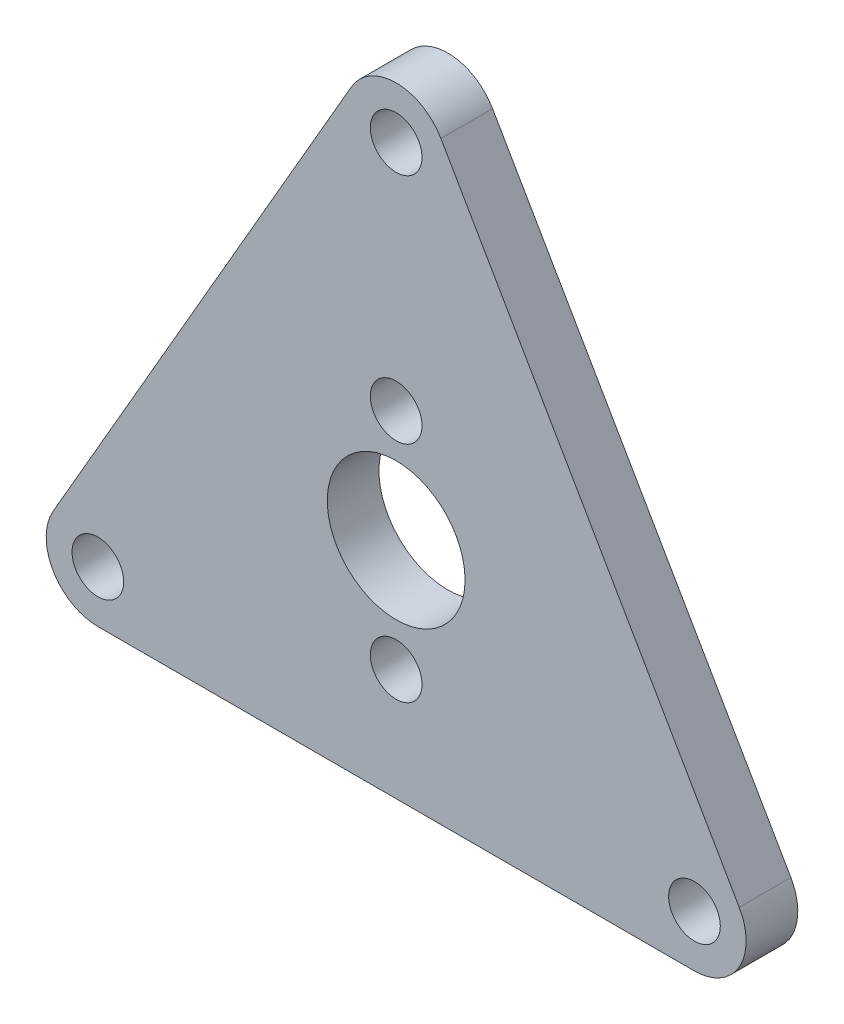
ISO-10303-21;
HEADER;
FILE_DESCRIPTION(('STEP AP214'),'2;1');
FILE_NAME('part.step','',(''),(''),'','','');
FILE_SCHEMA(('AUTOMOTIVE_DESIGN { 1 0 10303 214 1 1 1 1 }'));
ENDSEC;
DATA;
#1=APPLICATION_CONTEXT('core data for automotive mechanical design processes');
#2=APPLICATION_PROTOCOL_DEFINITION('international standard','automotive_design',2000,#1);
#3=PRODUCT_CONTEXT('',#1,'mechanical');
#4=PRODUCT('Part','Part','',(#3));
#5=PRODUCT_RELATED_PRODUCT_CATEGORY('part','',(#4));
#6=PRODUCT_DEFINITION_FORMATION('','',#4);
#7=PRODUCT_DEFINITION_CONTEXT('part definition',#1,'design');
#8=PRODUCT_DEFINITION('design','',#6,#7);
#9=PRODUCT_DEFINITION_SHAPE('','',#8);
#10=(LENGTH_UNIT() NAMED_UNIT(*) SI_UNIT(.MILLI.,.METRE.));
#11=(NAMED_UNIT(*) PLANE_ANGLE_UNIT() SI_UNIT($,.RADIAN.));
#12=(NAMED_UNIT(*) SI_UNIT($,.STERADIAN.) SOLID_ANGLE_UNIT());
#13=UNCERTAINTY_MEASURE_WITH_UNIT(LENGTH_MEASURE(1.E-05),#10,'distance_accuracy_value','');
#14=(GEOMETRIC_REPRESENTATION_CONTEXT(3) GLOBAL_UNCERTAINTY_ASSIGNED_CONTEXT((#13)) GLOBAL_UNIT_ASSIGNED_CONTEXT((#10,
#11,#12)) REPRESENTATION_CONTEXT('',''));
#15=CARTESIAN_POINT('',(0.,0.,0.));
#16=DIRECTION('',(0.,0.,1.));
#17=DIRECTION('',(1.,0.,0.));
#18=AXIS2_PLACEMENT_3D('',#15,#16,#17);
#19=CARTESIAN_POINT('',(-17.3205080756888,-9.99999999999999,3.));
#20=DIRECTION('',(0.,0.,1.));
#21=DIRECTION('',(1.,0.,0.));
#22=AXIS2_PLACEMENT_3D('',#19,#20,#21);
#23=PLANE('',#22);
#24=CARTESIAN_POINT('',(0.,6.5,3.));
#25=DIRECTION('',(0.,0.,1.));
#26=DIRECTION('',(1.,0.,0.));
#27=AXIS2_PLACEMENT_3D('',#24,#25,#26);
#28=CIRCLE('',#27,1.5);
#29=CARTESIAN_POINT('',(1.5,6.5,3.));
#30=VERTEX_POINT('',#29);
#31=EDGE_CURVE('E198',#30,#30,#28,.T.);
#32=ORIENTED_EDGE('',*,*,#31,.F.);
#33=EDGE_LOOP('',(#32));
#34=FACE_BOUND('',#33,.T.);
#35=CARTESIAN_POINT('',(17.3205080756888,-10.,3.));
#36=DIRECTION('',(0.,0.,1.));
#37=DIRECTION('',(1.,0.,0.));
#38=AXIS2_PLACEMENT_3D('',#35,#36,#37);
#39=CIRCLE('',#38,1.5);
#40=CARTESIAN_POINT('',(18.8205080756888,-10.,3.));
#41=VERTEX_POINT('',#40);
#42=EDGE_CURVE('E210',#41,#41,#39,.T.);
#43=ORIENTED_EDGE('',*,*,#42,.F.);
#44=EDGE_LOOP('',(#43));
#45=FACE_BOUND('',#44,.T.);
#46=CARTESIAN_POINT('',(-17.3205080756888,-10.,3.));
#47=DIRECTION('',(0.,0.,1.));
#48=DIRECTION('',(1.,0.,0.));
#49=AXIS2_PLACEMENT_3D('',#46,#47,#48);
#50=CIRCLE('',#49,1.5);
#51=CARTESIAN_POINT('',(-15.8205080756888,-10.,3.));
#52=VERTEX_POINT('',#51);
#53=EDGE_CURVE('E123',#52,#52,#50,.T.);
#54=ORIENTED_EDGE('',*,*,#53,.F.);
#55=EDGE_LOOP('',(#54));
#56=FACE_BOUND('',#55,.T.);
#57=CARTESIAN_POINT('',(-17.3205080756888,-9.99999999999999,3.));
#58=DIRECTION('',(0.,0.,1.));
#59=DIRECTION('',(1.,0.,0.));
#60=AXIS2_PLACEMENT_3D('',#57,#58,#59);
#61=CIRCLE('',#60,3.);
#62=CARTESIAN_POINT('',(-19.9185842870421,-8.49999999999999,3.));
#63=VERTEX_POINT('',#62);
#64=CARTESIAN_POINT('',(-17.3205080756888,-13.,3.));
#65=VERTEX_POINT('',#64);
#66=EDGE_CURVE('E130',#63,#65,#61,.T.);
#67=ORIENTED_EDGE('',*,*,#66,.T.);
#68=DIRECTION('',(1.,0.,0.));
#69=VECTOR('',#68,1.);
#70=CARTESIAN_POINT('',(-17.3205080756888,-13.,3.));
#71=LINE('',#70,#69);
#72=CARTESIAN_POINT('',(17.3205080756888,-13.,3.));
#73=VERTEX_POINT('',#72);
#74=EDGE_CURVE('E88',#65,#73,#71,.T.);
#75=ORIENTED_EDGE('',*,*,#74,.T.);
#76=CARTESIAN_POINT('',(17.3205080756888,-9.99999999999999,3.));
#77=DIRECTION('',(0.,0.,1.));
#78=DIRECTION('',(1.,0.,0.));
#79=AXIS2_PLACEMENT_3D('',#76,#77,#78);
#80=CIRCLE('',#79,3.);
#81=CARTESIAN_POINT('',(19.9185842870421,-8.49999999999999,3.));
#82=VERTEX_POINT('',#81);
#83=EDGE_CURVE('E101',#73,#82,#80,.T.);
#84=ORIENTED_EDGE('',*,*,#83,.T.);
#85=DIRECTION('',(-0.5,0.866025403784439,0.));
#86=VECTOR('',#85,1.);
#87=CARTESIAN_POINT('',(19.9185842870421,-8.49999999999999,3.));
#88=LINE('',#87,#86);
#89=CARTESIAN_POINT('',(2.59807621135331,21.5,3.));
#90=VERTEX_POINT('',#89);
#91=EDGE_CURVE('E95',#82,#90,#88,.T.);
#92=ORIENTED_EDGE('',*,*,#91,.T.);
#93=CARTESIAN_POINT('',(0.,20.,3.));
#94=DIRECTION('',(0.,0.,1.));
#95=DIRECTION('',(-1.,0.,0.));
#96=AXIS2_PLACEMENT_3D('',#93,#94,#95);
#97=CIRCLE('',#96,3.);
#98=CARTESIAN_POINT('',(-2.59807621135331,21.5,3.));
#99=VERTEX_POINT('',#98);
#100=EDGE_CURVE('E99',#90,#99,#97,.T.);
#101=ORIENTED_EDGE('',*,*,#100,.T.);
#102=DIRECTION('',(-0.5,-0.866025403784439,0.));
#103=VECTOR('',#102,1.);
#104=CARTESIAN_POINT('',(-2.59807621135331,21.5,3.));
#105=LINE('',#104,#103);
#106=EDGE_CURVE('E51',#99,#63,#105,.T.);
#107=ORIENTED_EDGE('',*,*,#106,.T.);
#108=EDGE_LOOP('',(#67,#75,#84,#92,#101,#107));
#109=FACE_BOUND('',#108,.T.);
#110=CARTESIAN_POINT('',(0.,20.,3.));
#111=DIRECTION('',(0.,0.,1.));
#112=DIRECTION('',(1.,0.,0.));
#113=AXIS2_PLACEMENT_3D('',#110,#111,#112);
#114=CIRCLE('',#113,1.5);
#115=CARTESIAN_POINT('',(1.5,20.,3.));
#116=VERTEX_POINT('',#115);
#117=EDGE_CURVE('E216',#116,#116,#114,.T.);
#118=ORIENTED_EDGE('',*,*,#117,.F.);
#119=EDGE_LOOP('',(#118));
#120=FACE_BOUND('',#119,.T.);
#121=CARTESIAN_POINT('',(0.,0.,3.));
#122=DIRECTION('',(0.,0.,1.));
#123=DIRECTION('',(1.,0.,0.));
#124=AXIS2_PLACEMENT_3D('',#121,#122,#123);
#125=CIRCLE('',#124,4.);
#126=CARTESIAN_POINT('',(4.,0.,3.));
#127=VERTEX_POINT('',#126);
#128=EDGE_CURVE('E204',#127,#127,#125,.T.);
#129=ORIENTED_EDGE('',*,*,#128,.F.);
#130=EDGE_LOOP('',(#129));
#131=FACE_BOUND('',#130,.T.);
#132=CARTESIAN_POINT('',(0.,-6.5,3.));
#133=DIRECTION('',(0.,0.,1.));
#134=DIRECTION('',(1.,0.,0.));
#135=AXIS2_PLACEMENT_3D('',#132,#133,#134);
#136=CIRCLE('',#135,1.5);
#137=CARTESIAN_POINT('',(1.5,-6.5,3.));
#138=VERTEX_POINT('',#137);
#139=EDGE_CURVE('E189',#138,#138,#136,.T.);
#140=ORIENTED_EDGE('',*,*,#139,.F.);
#141=EDGE_LOOP('',(#140));
#142=FACE_BOUND('',#141,.T.);
#143=ADVANCED_FACE('F34',(#34,#45,#56,#109,#120,#131,#142),#23,.T.);
#144=CARTESIAN_POINT('',(-17.3205080756888,-9.99999999999999,0.));
#145=DIRECTION('',(0.,0.,1.));
#146=DIRECTION('',(1.,0.,0.));
#147=AXIS2_PLACEMENT_3D('',#144,#145,#146);
#148=PLANE('',#147);
#149=CARTESIAN_POINT('',(-17.3205080756888,-9.99999999999999,0.));
#150=DIRECTION('',(0.,0.,1.));
#151=DIRECTION('',(1.,0.,0.));
#152=AXIS2_PLACEMENT_3D('',#149,#150,#151);
#153=CIRCLE('',#152,3.);
#154=CARTESIAN_POINT('',(-19.9185842870421,-8.49999999999999,0.));
#155=VERTEX_POINT('',#154);
#156=CARTESIAN_POINT('',(-17.3205080756888,-13.,0.));
#157=VERTEX_POINT('',#156);
#158=EDGE_CURVE('E119',#155,#157,#153,.T.);
#159=ORIENTED_EDGE('',*,*,#158,.F.);
#160=DIRECTION('',(-0.5,-0.866025403784439,0.));
#161=VECTOR('',#160,1.);
#162=CARTESIAN_POINT('',(-2.59807621135331,21.5,0.));
#163=LINE('',#162,#161);
#164=CARTESIAN_POINT('',(-2.59807621135331,21.5,0.));
#165=VERTEX_POINT('',#164);
#166=EDGE_CURVE('E80',#165,#155,#163,.T.);
#167=ORIENTED_EDGE('',*,*,#166,.F.);
#168=CARTESIAN_POINT('',(0.,20.,0.));
#169=DIRECTION('',(0.,0.,1.));
#170=DIRECTION('',(-1.,0.,0.));
#171=AXIS2_PLACEMENT_3D('',#168,#169,#170);
#172=CIRCLE('',#171,3.);
#173=CARTESIAN_POINT('',(2.59807621135331,21.5,0.));
#174=VERTEX_POINT('',#173);
#175=EDGE_CURVE('E74',#174,#165,#172,.T.);
#176=ORIENTED_EDGE('',*,*,#175,.F.);
#177=DIRECTION('',(-0.5,0.866025403784439,0.));
#178=VECTOR('',#177,1.);
#179=CARTESIAN_POINT('',(19.9185842870421,-8.49999999999999,0.));
#180=LINE('',#179,#178);
#181=CARTESIAN_POINT('',(19.9185842870421,-8.49999999999999,0.));
#182=VERTEX_POINT('',#181);
#183=EDGE_CURVE('E109',#182,#174,#180,.T.);
#184=ORIENTED_EDGE('',*,*,#183,.F.);
#185=CARTESIAN_POINT('',(17.3205080756888,-9.99999999999999,0.));
#186=DIRECTION('',(0.,0.,1.));
#187=DIRECTION('',(1.,0.,0.));
#188=AXIS2_PLACEMENT_3D('',#185,#186,#187);
#189=CIRCLE('',#188,3.);
#190=CARTESIAN_POINT('',(17.3205080756888,-13.,0.));
#191=VERTEX_POINT('',#190);
#192=EDGE_CURVE('E125',#191,#182,#189,.T.);
#193=ORIENTED_EDGE('',*,*,#192,.F.);
#194=DIRECTION('',(1.,0.,0.));
#195=VECTOR('',#194,1.);
#196=CARTESIAN_POINT('',(-17.3205080756888,-13.,0.));
#197=LINE('',#196,#195);
#198=EDGE_CURVE('E122',#157,#191,#197,.T.);
#199=ORIENTED_EDGE('',*,*,#198,.F.);
#200=EDGE_LOOP('',(#159,#167,#176,#184,#193,#199));
#201=FACE_BOUND('',#200,.T.);
#202=CARTESIAN_POINT('',(-17.3205080756888,-10.,0.));
#203=DIRECTION('',(0.,0.,1.));
#204=DIRECTION('',(1.,0.,0.));
#205=AXIS2_PLACEMENT_3D('',#202,#203,#204);
#206=CIRCLE('',#205,1.5);
#207=CARTESIAN_POINT('',(-15.8205080756888,-10.,0.));
#208=VERTEX_POINT('',#207);
#209=EDGE_CURVE('E219',#208,#208,#206,.T.);
#210=ORIENTED_EDGE('',*,*,#209,.T.);
#211=EDGE_LOOP('',(#210));
#212=FACE_BOUND('',#211,.T.);
#213=CARTESIAN_POINT('',(0.,20.,0.));
#214=DIRECTION('',(0.,0.,1.));
#215=DIRECTION('',(1.,0.,0.));
#216=AXIS2_PLACEMENT_3D('',#213,#214,#215);
#217=CIRCLE('',#216,1.5);
#218=CARTESIAN_POINT('',(1.5,20.,0.));
#219=VERTEX_POINT('',#218);
#220=EDGE_CURVE('E213',#219,#219,#217,.T.);
#221=ORIENTED_EDGE('',*,*,#220,.T.);
#222=EDGE_LOOP('',(#221));
#223=FACE_BOUND('',#222,.T.);
#224=CARTESIAN_POINT('',(17.3205080756888,-10.,0.));
#225=DIRECTION('',(0.,0.,1.));
#226=DIRECTION('',(1.,0.,0.));
#227=AXIS2_PLACEMENT_3D('',#224,#225,#226);
#228=CIRCLE('',#227,1.5);
#229=CARTESIAN_POINT('',(18.8205080756888,-10.,0.));
#230=VERTEX_POINT('',#229);
#231=EDGE_CURVE('E207',#230,#230,#228,.T.);
#232=ORIENTED_EDGE('',*,*,#231,.T.);
#233=EDGE_LOOP('',(#232));
#234=FACE_BOUND('',#233,.T.);
#235=CARTESIAN_POINT('',(0.,0.,0.));
#236=DIRECTION('',(0.,0.,1.));
#237=DIRECTION('',(1.,0.,0.));
#238=AXIS2_PLACEMENT_3D('',#235,#236,#237);
#239=CIRCLE('',#238,4.);
#240=CARTESIAN_POINT('',(4.,0.,0.));
#241=VERTEX_POINT('',#240);
#242=EDGE_CURVE('E201',#241,#241,#239,.T.);
#243=ORIENTED_EDGE('',*,*,#242,.T.);
#244=EDGE_LOOP('',(#243));
#245=FACE_BOUND('',#244,.T.);
#246=CARTESIAN_POINT('',(0.,6.5,0.));
#247=DIRECTION('',(0.,0.,1.));
#248=DIRECTION('',(1.,0.,0.));
#249=AXIS2_PLACEMENT_3D('',#246,#247,#248);
#250=CIRCLE('',#249,1.5);
#251=CARTESIAN_POINT('',(1.5,6.5,0.));
#252=VERTEX_POINT('',#251);
#253=EDGE_CURVE('E195',#252,#252,#250,.T.);
#254=ORIENTED_EDGE('',*,*,#253,.T.);
#255=EDGE_LOOP('',(#254));
#256=FACE_BOUND('',#255,.T.);
#257=CARTESIAN_POINT('',(0.,-6.5,0.));
#258=DIRECTION('',(0.,0.,1.));
#259=DIRECTION('',(1.,0.,0.));
#260=AXIS2_PLACEMENT_3D('',#257,#258,#259);
#261=CIRCLE('',#260,1.5);
#262=CARTESIAN_POINT('',(1.5,-6.5,0.));
#263=VERTEX_POINT('',#262);
#264=EDGE_CURVE('E192',#263,#263,#261,.T.);
#265=ORIENTED_EDGE('',*,*,#264,.T.);
#266=EDGE_LOOP('',(#265));
#267=FACE_BOUND('',#266,.T.);
#268=ADVANCED_FACE('F139',(#201,#212,#223,#234,#245,#256,#267),#148,.F.);
#269=CARTESIAN_POINT('',(-17.3205080756888,-9.99999999999999,3.));
#270=DIRECTION('',(0.,0.,-1.));
#271=DIRECTION('',(-1.,0.,0.));
#272=AXIS2_PLACEMENT_3D('',#269,#270,#271);
#273=CYLINDRICAL_SURFACE('',#272,3.);
#274=ORIENTED_EDGE('',*,*,#158,.T.);
#275=DIRECTION('',(0.,0.,-1.));
#276=VECTOR('',#275,1.);
#277=CARTESIAN_POINT('',(-17.3205080756888,-13.,3.));
#278=LINE('',#277,#276);
#279=EDGE_CURVE('E11',#65,#157,#278,.T.);
#280=ORIENTED_EDGE('',*,*,#279,.F.);
#281=ORIENTED_EDGE('',*,*,#66,.F.);
#282=DIRECTION('',(0.,0.,-1.));
#283=VECTOR('',#282,1.);
#284=CARTESIAN_POINT('',(-19.9185842870421,-8.49999999999999,3.));
#285=LINE('',#284,#283);
#286=EDGE_CURVE('E115',#63,#155,#285,.T.);
#287=ORIENTED_EDGE('',*,*,#286,.T.);
#288=EDGE_LOOP('',(#274,#280,#281,#287));
#289=FACE_BOUND('',#288,.T.);
#290=ADVANCED_FACE('F36',(#289),#273,.T.);
#291=CARTESIAN_POINT('',(-17.3205080756888,-13.,3.));
#292=DIRECTION('',(0.,1.,0.));
#293=DIRECTION('',(0.,0.,1.));
#294=AXIS2_PLACEMENT_3D('',#291,#292,#293);
#295=PLANE('',#294);
#296=ORIENTED_EDGE('',*,*,#198,.T.);
#297=DIRECTION('',(0.,0.,-1.));
#298=VECTOR('',#297,1.);
#299=CARTESIAN_POINT('',(17.3205080756888,-13.,3.));
#300=LINE('',#299,#298);
#301=EDGE_CURVE('E43',#73,#191,#300,.T.);
#302=ORIENTED_EDGE('',*,*,#301,.F.);
#303=ORIENTED_EDGE('',*,*,#74,.F.);
#304=ORIENTED_EDGE('',*,*,#279,.T.);
#305=EDGE_LOOP('',(#296,#302,#303,#304));
#306=FACE_BOUND('',#305,.T.);
#307=ADVANCED_FACE('F295',(#306),#295,.F.);
#308=CARTESIAN_POINT('',(17.3205080756888,-9.99999999999999,3.));
#309=DIRECTION('',(0.,0.,-1.));
#310=DIRECTION('',(-1.,0.,0.));
#311=AXIS2_PLACEMENT_3D('',#308,#309,#310);
#312=CYLINDRICAL_SURFACE('',#311,3.);
#313=ORIENTED_EDGE('',*,*,#192,.T.);
#314=DIRECTION('',(0.,0.,-1.));
#315=VECTOR('',#314,1.);
#316=CARTESIAN_POINT('',(19.9185842870421,-8.49999999999999,3.));
#317=LINE('',#316,#315);
#318=EDGE_CURVE('E110',#82,#182,#317,.T.);
#319=ORIENTED_EDGE('',*,*,#318,.F.);
#320=ORIENTED_EDGE('',*,*,#83,.F.);
#321=ORIENTED_EDGE('',*,*,#301,.T.);
#322=EDGE_LOOP('',(#313,#319,#320,#321));
#323=FACE_BOUND('',#322,.T.);
#324=ADVANCED_FACE('F136',(#323),#312,.T.);
#325=CARTESIAN_POINT('',(19.9185842870421,-8.49999999999999,3.));
#326=DIRECTION('',(-0.866025403784439,-0.5,0.));
#327=DIRECTION('',(0.5,-0.866025403784439,0.));
#328=AXIS2_PLACEMENT_3D('',#325,#326,#327);
#329=PLANE('',#328);
#330=ORIENTED_EDGE('',*,*,#183,.T.);
#331=DIRECTION('',(0.,0.,-1.));
#332=VECTOR('',#331,1.);
#333=CARTESIAN_POINT('',(2.59807621135331,21.5,3.));
#334=LINE('',#333,#332);
#335=EDGE_CURVE('E106',#90,#174,#334,.T.);
#336=ORIENTED_EDGE('',*,*,#335,.F.);
#337=ORIENTED_EDGE('',*,*,#91,.F.);
#338=ORIENTED_EDGE('',*,*,#318,.T.);
#339=EDGE_LOOP('',(#330,#336,#337,#338));
#340=FACE_BOUND('',#339,.T.);
#341=ADVANCED_FACE('F107',(#340),#329,.F.);
#342=CARTESIAN_POINT('',(0.,20.,3.));
#343=DIRECTION('',(0.,0.,-1.));
#344=DIRECTION('',(-1.,0.,0.));
#345=AXIS2_PLACEMENT_3D('',#342,#343,#344);
#346=CYLINDRICAL_SURFACE('',#345,3.);
#347=ORIENTED_EDGE('',*,*,#175,.T.);
#348=DIRECTION('',(0.,0.,-1.));
#349=VECTOR('',#348,1.);
#350=CARTESIAN_POINT('',(-2.59807621135331,21.5,3.));
#351=LINE('',#350,#349);
#352=EDGE_CURVE('E111',#99,#165,#351,.T.);
#353=ORIENTED_EDGE('',*,*,#352,.F.);
#354=ORIENTED_EDGE('',*,*,#100,.F.);
#355=ORIENTED_EDGE('',*,*,#335,.T.);
#356=EDGE_LOOP('',(#347,#353,#354,#355));
#357=FACE_BOUND('',#356,.T.);
#358=ADVANCED_FACE('F113',(#357),#346,.T.);
#359=CARTESIAN_POINT('',(-2.59807621135331,21.5,3.));
#360=DIRECTION('',(0.866025403784438,-0.5,0.));
#361=DIRECTION('',(0.5,0.866025403784439,0.));
#362=AXIS2_PLACEMENT_3D('',#359,#360,#361);
#363=PLANE('',#362);
#364=ORIENTED_EDGE('',*,*,#166,.T.);
#365=ORIENTED_EDGE('',*,*,#286,.F.);
#366=ORIENTED_EDGE('',*,*,#106,.F.);
#367=ORIENTED_EDGE('',*,*,#352,.T.);
#368=EDGE_LOOP('',(#364,#365,#366,#367));
#369=FACE_BOUND('',#368,.T.);
#370=ADVANCED_FACE('F144',(#369),#363,.F.);
#371=CARTESIAN_POINT('',(-17.3205080756888,-10.,3.));
#372=DIRECTION('',(0.,0.,-1.));
#373=DIRECTION('',(-1.,0.,0.));
#374=AXIS2_PLACEMENT_3D('',#371,#372,#373);
#375=CYLINDRICAL_SURFACE('',#374,1.5);
#376=ORIENTED_EDGE('',*,*,#53,.T.);
#377=EDGE_LOOP('',(#376));
#378=FACE_BOUND('',#377,.T.);
#379=ORIENTED_EDGE('',*,*,#209,.F.);
#380=EDGE_LOOP('',(#379));
#381=FACE_BOUND('',#380,.T.);
#382=ADVANCED_FACE('F146',(#378,#381),#375,.F.);
#383=CARTESIAN_POINT('',(0.,20.,3.));
#384=DIRECTION('',(0.,0.,-1.));
#385=DIRECTION('',(-1.,0.,0.));
#386=AXIS2_PLACEMENT_3D('',#383,#384,#385);
#387=CYLINDRICAL_SURFACE('',#386,1.5);
#388=ORIENTED_EDGE('',*,*,#117,.T.);
#389=EDGE_LOOP('',(#388));
#390=FACE_BOUND('',#389,.T.);
#391=ORIENTED_EDGE('',*,*,#220,.F.);
#392=EDGE_LOOP('',(#391));
#393=FACE_BOUND('',#392,.T.);
#394=ADVANCED_FACE('F152',(#390,#393),#387,.F.);
#395=CARTESIAN_POINT('',(17.3205080756888,-10.,3.));
#396=DIRECTION('',(0.,0.,-1.));
#397=DIRECTION('',(-1.,0.,0.));
#398=AXIS2_PLACEMENT_3D('',#395,#396,#397);
#399=CYLINDRICAL_SURFACE('',#398,1.5);
#400=ORIENTED_EDGE('',*,*,#42,.T.);
#401=EDGE_LOOP('',(#400));
#402=FACE_BOUND('',#401,.T.);
#403=ORIENTED_EDGE('',*,*,#231,.F.);
#404=EDGE_LOOP('',(#403));
#405=FACE_BOUND('',#404,.T.);
#406=ADVANCED_FACE('F168',(#402,#405),#399,.F.);
#407=CARTESIAN_POINT('',(0.,0.,3.));
#408=DIRECTION('',(0.,0.,-1.));
#409=DIRECTION('',(-1.,0.,0.));
#410=AXIS2_PLACEMENT_3D('',#407,#408,#409);
#411=CYLINDRICAL_SURFACE('',#410,4.);
#412=ORIENTED_EDGE('',*,*,#128,.T.);
#413=EDGE_LOOP('',(#412));
#414=FACE_BOUND('',#413,.T.);
#415=ORIENTED_EDGE('',*,*,#242,.F.);
#416=EDGE_LOOP('',(#415));
#417=FACE_BOUND('',#416,.T.);
#418=ADVANCED_FACE('F172',(#414,#417),#411,.F.);
#419=CARTESIAN_POINT('',(0.,6.5,3.));
#420=DIRECTION('',(0.,0.,-1.));
#421=DIRECTION('',(-1.,0.,0.));
#422=AXIS2_PLACEMENT_3D('',#419,#420,#421);
#423=CYLINDRICAL_SURFACE('',#422,1.5);
#424=ORIENTED_EDGE('',*,*,#31,.T.);
#425=EDGE_LOOP('',(#424));
#426=FACE_BOUND('',#425,.T.);
#427=ORIENTED_EDGE('',*,*,#253,.F.);
#428=EDGE_LOOP('',(#427));
#429=FACE_BOUND('',#428,.T.);
#430=ADVANCED_FACE('F176',(#426,#429),#423,.F.);
#431=CARTESIAN_POINT('',(0.,-6.5,3.));
#432=DIRECTION('',(0.,0.,-1.));
#433=DIRECTION('',(-1.,0.,0.));
#434=AXIS2_PLACEMENT_3D('',#431,#432,#433);
#435=CYLINDRICAL_SURFACE('',#434,1.5);
#436=ORIENTED_EDGE('',*,*,#139,.T.);
#437=EDGE_LOOP('',(#436));
#438=FACE_BOUND('',#437,.T.);
#439=ORIENTED_EDGE('',*,*,#264,.F.);
#440=EDGE_LOOP('',(#439));
#441=FACE_BOUND('',#440,.T.);
#442=ADVANCED_FACE('F180',(#438,#441),#435,.F.);
#443=CLOSED_SHELL('',(#143,#268,#290,#307,#324,#341,#358,#370,#382,#394,#406,#418,#430,#442));
#444=MANIFOLD_SOLID_BREP('B2',#443);
#445=ADVANCED_BREP_SHAPE_REPRESENTATION('',(#18,#444),#14);
#446=SHAPE_DEFINITION_REPRESENTATION(#9,#445);
ENDSEC;
END-ISO-10303-21;
